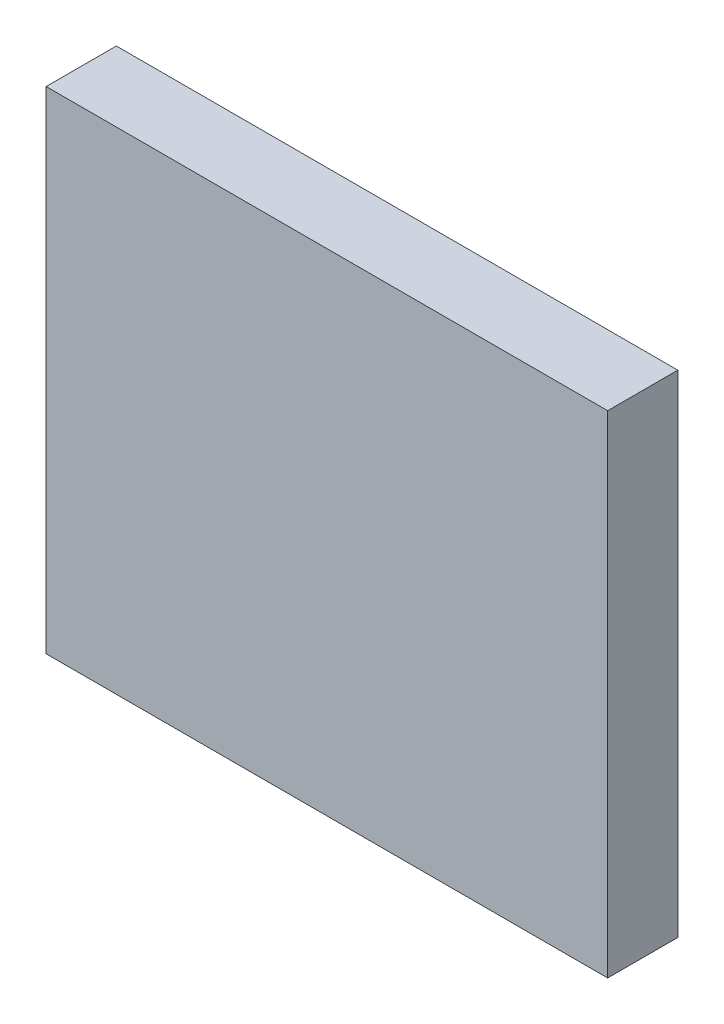
ISO-10303-21;
HEADER;
FILE_DESCRIPTION(('STEP AP214'),'2;1');
FILE_NAME('part.step','',(''),(''),'','','');
FILE_SCHEMA(('AUTOMOTIVE_DESIGN { 1 0 10303 214 1 1 1 1 }'));
ENDSEC;
DATA;
#1=APPLICATION_CONTEXT('core data for automotive mechanical design processes');
#2=APPLICATION_PROTOCOL_DEFINITION('international standard','automotive_design',2000,#1);
#3=PRODUCT_CONTEXT('',#1,'mechanical');
#4=PRODUCT('Part','Part','',(#3));
#5=PRODUCT_RELATED_PRODUCT_CATEGORY('part','',(#4));
#6=PRODUCT_DEFINITION_FORMATION('','',#4);
#7=PRODUCT_DEFINITION_CONTEXT('part definition',#1,'design');
#8=PRODUCT_DEFINITION('design','',#6,#7);
#9=PRODUCT_DEFINITION_SHAPE('','',#8);
#10=(LENGTH_UNIT() NAMED_UNIT(*) SI_UNIT(.MILLI.,.METRE.));
#11=(NAMED_UNIT(*) PLANE_ANGLE_UNIT() SI_UNIT($,.RADIAN.));
#12=(NAMED_UNIT(*) SI_UNIT($,.STERADIAN.) SOLID_ANGLE_UNIT());
#13=UNCERTAINTY_MEASURE_WITH_UNIT(LENGTH_MEASURE(1.E-05),#10,'distance_accuracy_value','');
#14=(GEOMETRIC_REPRESENTATION_CONTEXT(3) GLOBAL_UNCERTAINTY_ASSIGNED_CONTEXT((#13)) GLOBAL_UNIT_ASSIGNED_CONTEXT((#10,
#11,#12)) REPRESENTATION_CONTEXT('',''));
#15=CARTESIAN_POINT('',(0.,0.,0.));
#16=DIRECTION('',(0.,0.,1.));
#17=DIRECTION('',(1.,0.,0.));
#18=AXIS2_PLACEMENT_3D('',#15,#16,#17);
#19=CARTESIAN_POINT('',(0.,35.,0.));
#20=DIRECTION('',(0.,0.,1.));
#21=DIRECTION('',(1.,0.,0.));
#22=AXIS2_PLACEMENT_3D('',#19,#20,#21);
#23=PLANE('',#22);
#24=DIRECTION('',(0.,1.,0.));
#25=VECTOR('',#24,1.);
#26=CARTESIAN_POINT('',(-40.,70.,0.));
#27=LINE('',#26,#25);
#28=CARTESIAN_POINT('',(-40.,70.,0.));
#29=VERTEX_POINT('',#28);
#30=CARTESIAN_POINT('',(-40.,0.,0.));
#31=VERTEX_POINT('',#30);
#32=EDGE_CURVE('E79',#29,#31,#27,.F.);
#33=ORIENTED_EDGE('',*,*,#32,.F.);
#34=DIRECTION('',(-1.,0.,0.));
#35=VECTOR('',#34,1.);
#36=CARTESIAN_POINT('',(40.,70.,0.));
#37=LINE('',#36,#35);
#38=CARTESIAN_POINT('',(40.,70.,0.));
#39=VERTEX_POINT('',#38);
#40=EDGE_CURVE('E55',#39,#29,#37,.T.);
#41=ORIENTED_EDGE('',*,*,#40,.F.);
#42=DIRECTION('',(0.,1.,0.));
#43=VECTOR('',#42,1.);
#44=CARTESIAN_POINT('',(40.,0.,0.));
#45=LINE('',#44,#43);
#46=CARTESIAN_POINT('',(40.,0.,0.));
#47=VERTEX_POINT('',#46);
#48=EDGE_CURVE('E57',#47,#39,#45,.T.);
#49=ORIENTED_EDGE('',*,*,#48,.F.);
#50=DIRECTION('',(1.,0.,0.));
#51=VECTOR('',#50,1.);
#52=CARTESIAN_POINT('',(-40.,0.,0.));
#53=LINE('',#52,#51);
#54=EDGE_CURVE('E20',#31,#47,#53,.T.);
#55=ORIENTED_EDGE('',*,*,#54,.F.);
#56=EDGE_LOOP('',(#33,#41,#49,#55));
#57=FACE_BOUND('',#56,.T.);
#58=ADVANCED_FACE('F17',(#57),#23,.F.);
#59=CARTESIAN_POINT('',(-40.,0.,0.));
#60=DIRECTION('',(0.,-1.,0.));
#61=DIRECTION('',(1.,0.,0.));
#62=AXIS2_PLACEMENT_3D('',#59,#60,#61);
#63=PLANE('',#62);
#64=DIRECTION('',(1.,0.,0.));
#65=VECTOR('',#64,1.);
#66=CARTESIAN_POINT('',(0.,0.,10.));
#67=LINE('',#66,#65);
#68=CARTESIAN_POINT('',(-40.,0.,10.));
#69=VERTEX_POINT('',#68);
#70=CARTESIAN_POINT('',(40.,0.,10.));
#71=VERTEX_POINT('',#70);
#72=EDGE_CURVE('E83',#69,#71,#67,.T.);
#73=ORIENTED_EDGE('',*,*,#72,.F.);
#74=DIRECTION('',(0.,0.,1.));
#75=VECTOR('',#74,1.);
#76=CARTESIAN_POINT('',(-40.,0.,0.));
#77=LINE('',#76,#75);
#78=EDGE_CURVE('E68',#31,#69,#77,.T.);
#79=ORIENTED_EDGE('',*,*,#78,.F.);
#80=ORIENTED_EDGE('',*,*,#54,.T.);
#81=DIRECTION('',(0.,0.,1.));
#82=VECTOR('',#81,1.);
#83=CARTESIAN_POINT('',(40.,0.,0.));
#84=LINE('',#83,#82);
#85=EDGE_CURVE('E63',#71,#47,#84,.F.);
#86=ORIENTED_EDGE('',*,*,#85,.F.);
#87=EDGE_LOOP('',(#73,#79,#80,#86));
#88=FACE_BOUND('',#87,.T.);
#89=ADVANCED_FACE('F65',(#88),#63,.T.);
#90=CARTESIAN_POINT('',(40.,0.,0.));
#91=DIRECTION('',(1.,0.,0.));
#92=DIRECTION('',(0.,1.,0.));
#93=AXIS2_PLACEMENT_3D('',#90,#91,#92);
#94=PLANE('',#93);
#95=DIRECTION('',(0.,1.,0.));
#96=VECTOR('',#95,1.);
#97=CARTESIAN_POINT('',(40.,35.,10.));
#98=LINE('',#97,#96);
#99=CARTESIAN_POINT('',(40.,70.,10.));
#100=VERTEX_POINT('',#99);
#101=EDGE_CURVE('E72',#71,#100,#98,.T.);
#102=ORIENTED_EDGE('',*,*,#101,.F.);
#103=ORIENTED_EDGE('',*,*,#85,.T.);
#104=ORIENTED_EDGE('',*,*,#48,.T.);
#105=DIRECTION('',(0.,0.,1.));
#106=VECTOR('',#105,1.);
#107=CARTESIAN_POINT('',(40.,70.,0.));
#108=LINE('',#107,#106);
#109=EDGE_CURVE('E75',#100,#39,#108,.F.);
#110=ORIENTED_EDGE('',*,*,#109,.F.);
#111=EDGE_LOOP('',(#102,#103,#104,#110));
#112=FACE_BOUND('',#111,.T.);
#113=ADVANCED_FACE('F70',(#112),#94,.T.);
#114=CARTESIAN_POINT('',(40.,70.,0.));
#115=DIRECTION('',(0.,1.,0.));
#116=DIRECTION('',(-1.,0.,0.));
#117=AXIS2_PLACEMENT_3D('',#114,#115,#116);
#118=PLANE('',#117);
#119=DIRECTION('',(1.,0.,0.));
#120=VECTOR('',#119,1.);
#121=CARTESIAN_POINT('',(0.,70.,10.));
#122=LINE('',#121,#120);
#123=CARTESIAN_POINT('',(-40.,70.,10.));
#124=VERTEX_POINT('',#123);
#125=EDGE_CURVE('E26',#100,#124,#122,.F.);
#126=ORIENTED_EDGE('',*,*,#125,.F.);
#127=ORIENTED_EDGE('',*,*,#109,.T.);
#128=ORIENTED_EDGE('',*,*,#40,.T.);
#129=DIRECTION('',(0.,0.,1.));
#130=VECTOR('',#129,1.);
#131=CARTESIAN_POINT('',(-40.,70.,0.));
#132=LINE('',#131,#130);
#133=EDGE_CURVE('E35',#124,#29,#132,.F.);
#134=ORIENTED_EDGE('',*,*,#133,.F.);
#135=EDGE_LOOP('',(#126,#127,#128,#134));
#136=FACE_BOUND('',#135,.T.);
#137=ADVANCED_FACE('F89',(#136),#118,.T.);
#138=CARTESIAN_POINT('',(-40.,70.,0.));
#139=DIRECTION('',(-1.,0.,0.));
#140=DIRECTION('',(0.,0.,1.));
#141=AXIS2_PLACEMENT_3D('',#138,#139,#140);
#142=PLANE('',#141);
#143=DIRECTION('',(0.,1.,0.));
#144=VECTOR('',#143,1.);
#145=CARTESIAN_POINT('',(-40.,35.,10.));
#146=LINE('',#145,#144);
#147=EDGE_CURVE('E11',#124,#69,#146,.F.);
#148=ORIENTED_EDGE('',*,*,#147,.F.);
#149=ORIENTED_EDGE('',*,*,#133,.T.);
#150=ORIENTED_EDGE('',*,*,#32,.T.);
#151=ORIENTED_EDGE('',*,*,#78,.T.);
#152=EDGE_LOOP('',(#148,#149,#150,#151));
#153=FACE_BOUND('',#152,.T.);
#154=ADVANCED_FACE('F91',(#153),#142,.T.);
#155=CARTESIAN_POINT('',(0.,35.,10.));
#156=DIRECTION('',(0.,0.,1.));
#157=DIRECTION('',(1.,0.,0.));
#158=AXIS2_PLACEMENT_3D('',#155,#156,#157);
#159=PLANE('',#158);
#160=ORIENTED_EDGE('',*,*,#125,.T.);
#161=ORIENTED_EDGE('',*,*,#147,.T.);
#162=ORIENTED_EDGE('',*,*,#72,.T.);
#163=ORIENTED_EDGE('',*,*,#101,.T.);
#164=EDGE_LOOP('',(#160,#161,#162,#163));
#165=FACE_BOUND('',#164,.T.);
#166=ADVANCED_FACE('F88',(#165),#159,.T.);
#167=CLOSED_SHELL('',(#58,#89,#113,#137,#154,#166));
#168=MANIFOLD_SOLID_BREP('B1',#167);
#169=ADVANCED_BREP_SHAPE_REPRESENTATION('',(#18,#168),#14);
#170=SHAPE_DEFINITION_REPRESENTATION(#9,#169);
ENDSEC;
END-ISO-10303-21;
